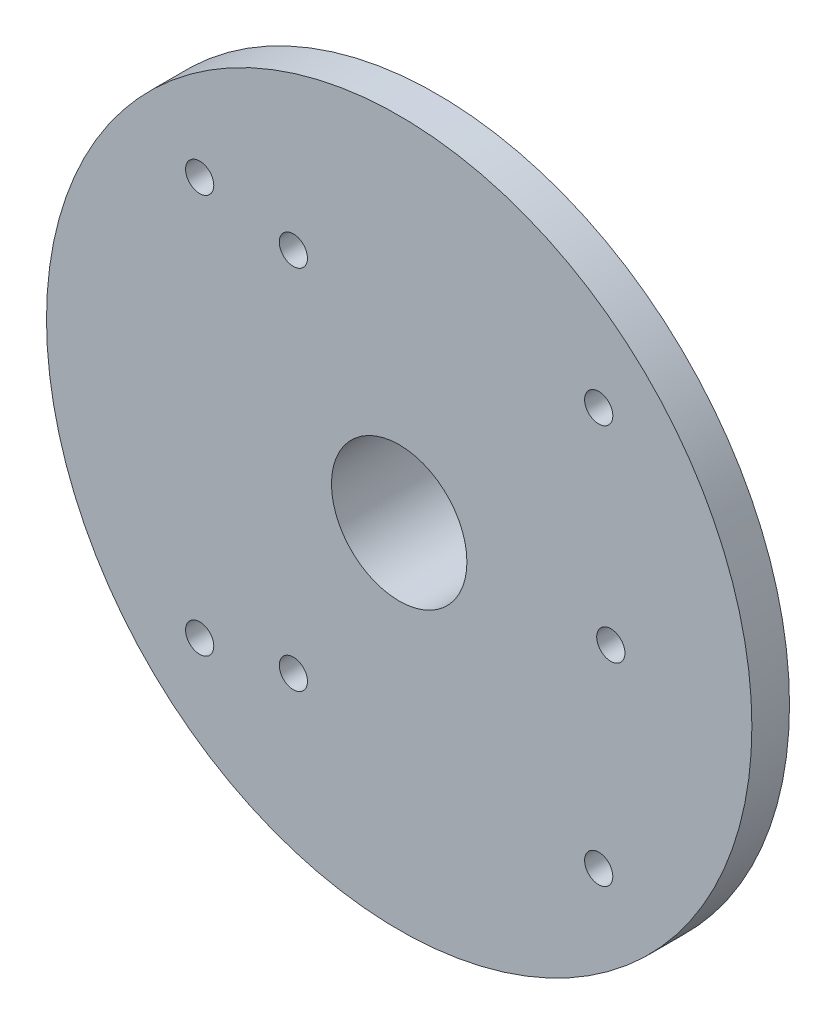
ISO-10303-21;
HEADER;
FILE_DESCRIPTION(('STEP AP214'),'2;1');
FILE_NAME('part.step','',(''),(''),'','','');
FILE_SCHEMA(('AUTOMOTIVE_DESIGN { 1 0 10303 214 1 1 1 1 }'));
ENDSEC;
DATA;
#1=APPLICATION_CONTEXT('core data for automotive mechanical design processes');
#2=APPLICATION_PROTOCOL_DEFINITION('international standard','automotive_design',2000,#1);
#3=PRODUCT_CONTEXT('',#1,'mechanical');
#4=PRODUCT('Part','Part','',(#3));
#5=PRODUCT_RELATED_PRODUCT_CATEGORY('part','',(#4));
#6=PRODUCT_DEFINITION_FORMATION('','',#4);
#7=PRODUCT_DEFINITION_CONTEXT('part definition',#1,'design');
#8=PRODUCT_DEFINITION('design','',#6,#7);
#9=PRODUCT_DEFINITION_SHAPE('','',#8);
#10=(LENGTH_UNIT() NAMED_UNIT(*) SI_UNIT(.MILLI.,.METRE.));
#11=(NAMED_UNIT(*) PLANE_ANGLE_UNIT() SI_UNIT($,.RADIAN.));
#12=(NAMED_UNIT(*) SI_UNIT($,.STERADIAN.) SOLID_ANGLE_UNIT());
#13=UNCERTAINTY_MEASURE_WITH_UNIT(LENGTH_MEASURE(1.E-05),#10,'distance_accuracy_value','');
#14=(GEOMETRIC_REPRESENTATION_CONTEXT(3) GLOBAL_UNCERTAINTY_ASSIGNED_CONTEXT((#13)) GLOBAL_UNIT_ASSIGNED_CONTEXT((#10,
#11,#12)) REPRESENTATION_CONTEXT('',''));
#15=CARTESIAN_POINT('',(0.,0.,0.));
#16=DIRECTION('',(0.,0.,1.));
#17=DIRECTION('',(1.,0.,0.));
#18=AXIS2_PLACEMENT_3D('',#15,#16,#17);
#19=CARTESIAN_POINT('',(0.,0.,0.));
#20=DIRECTION('',(0.,0.,1.));
#21=DIRECTION('',(1.,0.,0.));
#22=AXIS2_PLACEMENT_3D('',#19,#20,#21);
#23=PLANE('',#22);
#24=CARTESIAN_POINT('',(-21.2132034355962,21.2132034355966,0.));
#25=DIRECTION('',(0.,0.,1.));
#26=DIRECTION('',(1.,0.,0.));
#27=AXIS2_PLACEMENT_3D('',#24,#25,#26);
#28=CIRCLE('',#27,1.5);
#29=CARTESIAN_POINT('',(-19.7132034355962,21.2132034355966,0.));
#30=VERTEX_POINT('',#29);
#31=EDGE_CURVE('E112',#30,#30,#28,.T.);
#32=ORIENTED_EDGE('',*,*,#31,.T.);
#33=EDGE_LOOP('',(#32));
#34=FACE_BOUND('',#33,.T.);
#35=CARTESIAN_POINT('',(-21.2132034355952,-21.2132034355976,0.));
#36=DIRECTION('',(0.,0.,1.));
#37=DIRECTION('',(1.,0.,0.));
#38=AXIS2_PLACEMENT_3D('',#35,#36,#37);
#39=CIRCLE('',#38,1.50000000000089);
#40=CARTESIAN_POINT('',(-19.7132034355943,-21.2132034355976,0.));
#41=VERTEX_POINT('',#40);
#42=EDGE_CURVE('E104',#41,#41,#39,.T.);
#43=ORIENTED_EDGE('',*,*,#42,.T.);
#44=EDGE_LOOP('',(#43));
#45=FACE_BOUND('',#44,.T.);
#46=CARTESIAN_POINT('',(21.2132034355964,-21.2132034355965,0.));
#47=DIRECTION('',(0.,0.,1.));
#48=DIRECTION('',(1.,0.,0.));
#49=AXIS2_PLACEMENT_3D('',#46,#47,#48);
#50=CIRCLE('',#49,1.5);
#51=CARTESIAN_POINT('',(22.7132034355964,-21.2132034355965,0.));
#52=VERTEX_POINT('',#51);
#53=EDGE_CURVE('E96',#52,#52,#50,.T.);
#54=ORIENTED_EDGE('',*,*,#53,.T.);
#55=EDGE_LOOP('',(#54));
#56=FACE_BOUND('',#55,.T.);
#57=CARTESIAN_POINT('',(-11.25,19.4855715851499,0.));
#58=DIRECTION('',(0.,0.,1.));
#59=DIRECTION('',(1.,0.,0.));
#60=AXIS2_PLACEMENT_3D('',#57,#58,#59);
#61=CIRCLE('',#60,1.5);
#62=CARTESIAN_POINT('',(-9.75000000000001,19.4855715851499,0.));
#63=VERTEX_POINT('',#62);
#64=EDGE_CURVE('E88',#63,#63,#61,.T.);
#65=ORIENTED_EDGE('',*,*,#64,.T.);
#66=EDGE_LOOP('',(#65));
#67=FACE_BOUND('',#66,.T.);
#68=CARTESIAN_POINT('',(-11.25,-19.4855715851499,0.));
#69=DIRECTION('',(0.,0.,1.));
#70=DIRECTION('',(1.,0.,0.));
#71=AXIS2_PLACEMENT_3D('',#68,#69,#70);
#72=CIRCLE('',#71,1.5);
#73=CARTESIAN_POINT('',(-9.74999999999999,-19.4855715851499,0.));
#74=VERTEX_POINT('',#73);
#75=EDGE_CURVE('E80',#74,#74,#72,.T.);
#76=ORIENTED_EDGE('',*,*,#75,.T.);
#77=EDGE_LOOP('',(#76));
#78=FACE_BOUND('',#77,.T.);
#79=CARTESIAN_POINT('',(21.2132034355964,21.2132034355965,0.));
#80=DIRECTION('',(0.,0.,1.));
#81=DIRECTION('',(1.,0.,0.));
#82=AXIS2_PLACEMENT_3D('',#79,#80,#81);
#83=CIRCLE('',#82,1.5);
#84=CARTESIAN_POINT('',(22.7132034355964,21.2132034355965,0.));
#85=VERTEX_POINT('',#84);
#86=EDGE_CURVE('E72',#85,#85,#83,.T.);
#87=ORIENTED_EDGE('',*,*,#86,.T.);
#88=EDGE_LOOP('',(#87));
#89=FACE_BOUND('',#88,.T.);
#90=CARTESIAN_POINT('',(22.5,0.,0.));
#91=DIRECTION('',(0.,0.,1.));
#92=DIRECTION('',(1.,0.,0.));
#93=AXIS2_PLACEMENT_3D('',#90,#91,#92);
#94=CIRCLE('',#93,1.5);
#95=CARTESIAN_POINT('',(24.,0.,0.));
#96=VERTEX_POINT('',#95);
#97=EDGE_CURVE('E60',#96,#96,#94,.T.);
#98=ORIENTED_EDGE('',*,*,#97,.T.);
#99=EDGE_LOOP('',(#98));
#100=FACE_BOUND('',#99,.T.);
#101=CARTESIAN_POINT('',(0.,0.,0.));
#102=DIRECTION('',(0.,0.,1.));
#103=DIRECTION('',(1.,0.,0.));
#104=AXIS2_PLACEMENT_3D('',#101,#102,#103);
#105=CIRCLE('',#104,37.5);
#106=CARTESIAN_POINT('',(37.5,0.,0.));
#107=VERTEX_POINT('',#106);
#108=EDGE_CURVE('E52',#107,#107,#105,.T.);
#109=ORIENTED_EDGE('',*,*,#108,.F.);
#110=EDGE_LOOP('',(#109));
#111=FACE_BOUND('',#110,.T.);
#112=CARTESIAN_POINT('',(0.,0.,0.));
#113=DIRECTION('',(0.,0.,1.));
#114=DIRECTION('',(1.,0.,0.));
#115=AXIS2_PLACEMENT_3D('',#112,#113,#114);
#116=CIRCLE('',#115,11.2);
#117=CARTESIAN_POINT('',(11.2,0.,0.));
#118=VERTEX_POINT('',#117);
#119=EDGE_CURVE('E10',#118,#118,#116,.F.);
#120=ORIENTED_EDGE('',*,*,#119,.F.);
#121=EDGE_LOOP('',(#120));
#122=FACE_BOUND('',#121,.T.);
#123=ADVANCED_FACE('F39',(#34,#45,#56,#67,#78,#89,#100,#111,#122),#23,.F.);
#124=CARTESIAN_POINT('',(0.,0.,4.));
#125=DIRECTION('',(0.,0.,1.));
#126=DIRECTION('',(1.,0.,0.));
#127=AXIS2_PLACEMENT_3D('',#124,#125,#126);
#128=PLANE('',#127);
#129=CARTESIAN_POINT('',(-21.2132034355952,-21.2132034355976,4.));
#130=DIRECTION('',(0.,0.,1.));
#131=DIRECTION('',(1.,0.,0.));
#132=AXIS2_PLACEMENT_3D('',#129,#130,#131);
#133=CIRCLE('',#132,1.50000000000089);
#134=CARTESIAN_POINT('',(-19.7132034355943,-21.2132034355976,4.));
#135=VERTEX_POINT('',#134);
#136=EDGE_CURVE('E100',#135,#135,#133,.T.);
#137=ORIENTED_EDGE('',*,*,#136,.F.);
#138=EDGE_LOOP('',(#137));
#139=FACE_BOUND('',#138,.T.);
#140=CARTESIAN_POINT('',(-11.25,19.4855715851499,4.));
#141=DIRECTION('',(0.,0.,1.));
#142=DIRECTION('',(1.,0.,0.));
#143=AXIS2_PLACEMENT_3D('',#140,#141,#142);
#144=CIRCLE('',#143,1.5);
#145=CARTESIAN_POINT('',(-9.75000000000001,19.4855715851499,4.));
#146=VERTEX_POINT('',#145);
#147=EDGE_CURVE('E84',#146,#146,#144,.T.);
#148=ORIENTED_EDGE('',*,*,#147,.F.);
#149=EDGE_LOOP('',(#148));
#150=FACE_BOUND('',#149,.T.);
#151=CARTESIAN_POINT('',(21.2132034355964,21.2132034355965,4.));
#152=DIRECTION('',(0.,0.,1.));
#153=DIRECTION('',(1.,0.,0.));
#154=AXIS2_PLACEMENT_3D('',#151,#152,#153);
#155=CIRCLE('',#154,1.5);
#156=CARTESIAN_POINT('',(22.7132034355964,21.2132034355965,4.));
#157=VERTEX_POINT('',#156);
#158=EDGE_CURVE('E71',#157,#157,#155,.T.);
#159=ORIENTED_EDGE('',*,*,#158,.F.);
#160=EDGE_LOOP('',(#159));
#161=FACE_BOUND('',#160,.T.);
#162=CARTESIAN_POINT('',(22.5,0.,4.));
#163=DIRECTION('',(0.,0.,1.));
#164=DIRECTION('',(1.,0.,0.));
#165=AXIS2_PLACEMENT_3D('',#162,#163,#164);
#166=CIRCLE('',#165,1.5);
#167=CARTESIAN_POINT('',(24.,0.,4.));
#168=VERTEX_POINT('',#167);
#169=EDGE_CURVE('E58',#168,#168,#166,.T.);
#170=ORIENTED_EDGE('',*,*,#169,.F.);
#171=EDGE_LOOP('',(#170));
#172=FACE_BOUND('',#171,.T.);
#173=CARTESIAN_POINT('',(0.,0.,4.));
#174=DIRECTION('',(0.,0.,1.));
#175=DIRECTION('',(1.,0.,0.));
#176=AXIS2_PLACEMENT_3D('',#173,#174,#175);
#177=CIRCLE('',#176,37.5);
#178=CARTESIAN_POINT('',(37.5,0.,4.));
#179=VERTEX_POINT('',#178);
#180=EDGE_CURVE('E47',#179,#179,#177,.T.);
#181=ORIENTED_EDGE('',*,*,#180,.T.);
#182=EDGE_LOOP('',(#181));
#183=FACE_BOUND('',#182,.T.);
#184=CARTESIAN_POINT('',(0.,0.,4.));
#185=DIRECTION('',(0.,0.,1.));
#186=DIRECTION('',(1.,0.,0.));
#187=AXIS2_PLACEMENT_3D('',#184,#185,#186);
#188=CIRCLE('',#187,7.2);
#189=CARTESIAN_POINT('',(7.2,0.,4.));
#190=VERTEX_POINT('',#189);
#191=EDGE_CURVE('E64',#190,#190,#188,.T.);
#192=ORIENTED_EDGE('',*,*,#191,.F.);
#193=EDGE_LOOP('',(#192));
#194=FACE_BOUND('',#193,.T.);
#195=CARTESIAN_POINT('',(-11.25,-19.4855715851499,4.));
#196=DIRECTION('',(0.,0.,1.));
#197=DIRECTION('',(1.,0.,0.));
#198=AXIS2_PLACEMENT_3D('',#195,#196,#197);
#199=CIRCLE('',#198,1.5);
#200=CARTESIAN_POINT('',(-9.74999999999999,-19.4855715851499,4.));
#201=VERTEX_POINT('',#200);
#202=EDGE_CURVE('E76',#201,#201,#199,.T.);
#203=ORIENTED_EDGE('',*,*,#202,.F.);
#204=EDGE_LOOP('',(#203));
#205=FACE_BOUND('',#204,.T.);
#206=CARTESIAN_POINT('',(21.2132034355964,-21.2132034355965,4.));
#207=DIRECTION('',(0.,0.,1.));
#208=DIRECTION('',(1.,0.,0.));
#209=AXIS2_PLACEMENT_3D('',#206,#207,#208);
#210=CIRCLE('',#209,1.5);
#211=CARTESIAN_POINT('',(22.7132034355964,-21.2132034355965,4.));
#212=VERTEX_POINT('',#211);
#213=EDGE_CURVE('E92',#212,#212,#210,.T.);
#214=ORIENTED_EDGE('',*,*,#213,.F.);
#215=EDGE_LOOP('',(#214));
#216=FACE_BOUND('',#215,.T.);
#217=CARTESIAN_POINT('',(-21.2132034355962,21.2132034355966,4.));
#218=DIRECTION('',(0.,0.,1.));
#219=DIRECTION('',(1.,0.,0.));
#220=AXIS2_PLACEMENT_3D('',#217,#218,#219);
#221=CIRCLE('',#220,1.5);
#222=CARTESIAN_POINT('',(-19.7132034355962,21.2132034355966,4.));
#223=VERTEX_POINT('',#222);
#224=EDGE_CURVE('E108',#223,#223,#221,.T.);
#225=ORIENTED_EDGE('',*,*,#224,.F.);
#226=EDGE_LOOP('',(#225));
#227=FACE_BOUND('',#226,.T.);
#228=ADVANCED_FACE('F146',(#139,#150,#161,#172,#183,#194,#205,#216,#227),#128,.T.);
#229=CARTESIAN_POINT('',(0.,0.,4.));
#230=DIRECTION('',(0.,0.,-1.));
#231=DIRECTION('',(-1.,0.,0.));
#232=AXIS2_PLACEMENT_3D('',#229,#230,#231);
#233=CYLINDRICAL_SURFACE('',#232,37.5);
#234=ORIENTED_EDGE('',*,*,#180,.F.);
#235=EDGE_LOOP('',(#234));
#236=FACE_BOUND('',#235,.T.);
#237=ORIENTED_EDGE('',*,*,#108,.T.);
#238=EDGE_LOOP('',(#237));
#239=FACE_BOUND('',#238,.T.);
#240=ADVANCED_FACE('F41',(#236,#239),#233,.T.);
#241=CARTESIAN_POINT('',(22.5,0.,4.));
#242=DIRECTION('',(0.,0.,-1.));
#243=DIRECTION('',(-1.,0.,0.));
#244=AXIS2_PLACEMENT_3D('',#241,#242,#243);
#245=CYLINDRICAL_SURFACE('',#244,1.5);
#246=ORIENTED_EDGE('',*,*,#169,.T.);
#247=EDGE_LOOP('',(#246));
#248=FACE_BOUND('',#247,.T.);
#249=ORIENTED_EDGE('',*,*,#97,.F.);
#250=EDGE_LOOP('',(#249));
#251=FACE_BOUND('',#250,.T.);
#252=ADVANCED_FACE('F155',(#248,#251),#245,.F.);
#253=CARTESIAN_POINT('',(0.,0.,4.));
#254=DIRECTION('',(0.,0.,-1.));
#255=DIRECTION('',(-1.,0.,0.));
#256=AXIS2_PLACEMENT_3D('',#253,#254,#255);
#257=CYLINDRICAL_SURFACE('',#256,7.2);
#258=ORIENTED_EDGE('',*,*,#191,.T.);
#259=EDGE_LOOP('',(#258));
#260=FACE_BOUND('',#259,.T.);
#261=CARTESIAN_POINT('',(0.,0.,-8.));
#262=DIRECTION('',(0.,0.,-1.));
#263=DIRECTION('',(-1.,0.,0.));
#264=AXIS2_PLACEMENT_3D('',#261,#262,#263);
#265=CIRCLE('',#264,7.2);
#266=CARTESIAN_POINT('',(-7.2,0.,-8.));
#267=VERTEX_POINT('',#266);
#268=EDGE_CURVE('E123',#267,#267,#265,.T.);
#269=ORIENTED_EDGE('',*,*,#268,.T.);
#270=EDGE_LOOP('',(#269));
#271=FACE_BOUND('',#270,.T.);
#272=ADVANCED_FACE('F128',(#260,#271),#257,.F.);
#273=CARTESIAN_POINT('',(21.2132034355964,21.2132034355965,4.));
#274=DIRECTION('',(0.,0.,-1.));
#275=DIRECTION('',(-1.,0.,0.));
#276=AXIS2_PLACEMENT_3D('',#273,#274,#275);
#277=CYLINDRICAL_SURFACE('',#276,1.5);
#278=ORIENTED_EDGE('',*,*,#158,.T.);
#279=EDGE_LOOP('',(#278));
#280=FACE_BOUND('',#279,.T.);
#281=ORIENTED_EDGE('',*,*,#86,.F.);
#282=EDGE_LOOP('',(#281));
#283=FACE_BOUND('',#282,.T.);
#284=ADVANCED_FACE('F161',(#280,#283),#277,.F.);
#285=CARTESIAN_POINT('',(-11.25,-19.4855715851499,4.));
#286=DIRECTION('',(0.,0.,-1.));
#287=DIRECTION('',(-1.,0.,0.));
#288=AXIS2_PLACEMENT_3D('',#285,#286,#287);
#289=CYLINDRICAL_SURFACE('',#288,1.5);
#290=ORIENTED_EDGE('',*,*,#202,.T.);
#291=EDGE_LOOP('',(#290));
#292=FACE_BOUND('',#291,.T.);
#293=ORIENTED_EDGE('',*,*,#75,.F.);
#294=EDGE_LOOP('',(#293));
#295=FACE_BOUND('',#294,.T.);
#296=ADVANCED_FACE('F165',(#292,#295),#289,.F.);
#297=CARTESIAN_POINT('',(-11.25,19.4855715851499,4.));
#298=DIRECTION('',(0.,0.,-1.));
#299=DIRECTION('',(-1.,0.,0.));
#300=AXIS2_PLACEMENT_3D('',#297,#298,#299);
#301=CYLINDRICAL_SURFACE('',#300,1.5);
#302=ORIENTED_EDGE('',*,*,#147,.T.);
#303=EDGE_LOOP('',(#302));
#304=FACE_BOUND('',#303,.T.);
#305=ORIENTED_EDGE('',*,*,#64,.F.);
#306=EDGE_LOOP('',(#305));
#307=FACE_BOUND('',#306,.T.);
#308=ADVANCED_FACE('F169',(#304,#307),#301,.F.);
#309=CARTESIAN_POINT('',(21.2132034355964,-21.2132034355965,4.));
#310=DIRECTION('',(0.,0.,-1.));
#311=DIRECTION('',(-1.,0.,0.));
#312=AXIS2_PLACEMENT_3D('',#309,#310,#311);
#313=CYLINDRICAL_SURFACE('',#312,1.5);
#314=ORIENTED_EDGE('',*,*,#213,.T.);
#315=EDGE_LOOP('',(#314));
#316=FACE_BOUND('',#315,.T.);
#317=ORIENTED_EDGE('',*,*,#53,.F.);
#318=EDGE_LOOP('',(#317));
#319=FACE_BOUND('',#318,.T.);
#320=ADVANCED_FACE('F173',(#316,#319),#313,.F.);
#321=CARTESIAN_POINT('',(-21.2132034355952,-21.2132034355976,4.));
#322=DIRECTION('',(0.,0.,-1.));
#323=DIRECTION('',(-1.,0.,0.));
#324=AXIS2_PLACEMENT_3D('',#321,#322,#323);
#325=CYLINDRICAL_SURFACE('',#324,1.50000000000089);
#326=ORIENTED_EDGE('',*,*,#136,.T.);
#327=EDGE_LOOP('',(#326));
#328=FACE_BOUND('',#327,.T.);
#329=ORIENTED_EDGE('',*,*,#42,.F.);
#330=EDGE_LOOP('',(#329));
#331=FACE_BOUND('',#330,.T.);
#332=ADVANCED_FACE('F142',(#328,#331),#325,.F.);
#333=CARTESIAN_POINT('',(-21.2132034355962,21.2132034355966,4.));
#334=DIRECTION('',(0.,0.,-1.));
#335=DIRECTION('',(-1.,0.,0.));
#336=AXIS2_PLACEMENT_3D('',#333,#334,#335);
#337=CYLINDRICAL_SURFACE('',#336,1.5);
#338=ORIENTED_EDGE('',*,*,#224,.T.);
#339=EDGE_LOOP('',(#338));
#340=FACE_BOUND('',#339,.T.);
#341=ORIENTED_EDGE('',*,*,#31,.F.);
#342=EDGE_LOOP('',(#341));
#343=FACE_BOUND('',#342,.T.);
#344=ADVANCED_FACE('F133',(#340,#343),#337,.F.);
#345=CARTESIAN_POINT('',(0.,0.,-8.));
#346=DIRECTION('',(0.,0.,-1.));
#347=DIRECTION('',(-1.,0.,0.));
#348=AXIS2_PLACEMENT_3D('',#345,#346,#347);
#349=PLANE('',#348);
#350=CARTESIAN_POINT('',(0.,0.,-8.));
#351=DIRECTION('',(0.,0.,-1.));
#352=DIRECTION('',(-1.,0.,0.));
#353=AXIS2_PLACEMENT_3D('',#350,#351,#352);
#354=CIRCLE('',#353,11.2);
#355=CARTESIAN_POINT('',(-11.2,0.,-8.));
#356=VERTEX_POINT('',#355);
#357=EDGE_CURVE('E116',#356,#356,#354,.T.);
#358=ORIENTED_EDGE('',*,*,#357,.T.);
#359=EDGE_LOOP('',(#358));
#360=FACE_BOUND('',#359,.T.);
#361=ORIENTED_EDGE('',*,*,#268,.F.);
#362=EDGE_LOOP('',(#361));
#363=FACE_BOUND('',#362,.T.);
#364=ADVANCED_FACE('F130',(#360,#363),#349,.T.);
#365=CARTESIAN_POINT('',(0.,0.,-8.));
#366=DIRECTION('',(0.,0.,1.));
#367=DIRECTION('',(1.,0.,0.));
#368=AXIS2_PLACEMENT_3D('',#365,#366,#367);
#369=CYLINDRICAL_SURFACE('',#368,11.2);
#370=ORIENTED_EDGE('',*,*,#357,.F.);
#371=EDGE_LOOP('',(#370));
#372=FACE_BOUND('',#371,.T.);
#373=ORIENTED_EDGE('',*,*,#119,.T.);
#374=EDGE_LOOP('',(#373));
#375=FACE_BOUND('',#374,.T.);
#376=ADVANCED_FACE('F132',(#372,#375),#369,.T.);
#377=CLOSED_SHELL('',(#123,#228,#240,#252,#272,#284,#296,#308,#320,#332,#344,#364,#376));
#378=MANIFOLD_SOLID_BREP('B2',#377);
#379=ADVANCED_BREP_SHAPE_REPRESENTATION('',(#18,#378),#14);
#380=SHAPE_DEFINITION_REPRESENTATION(#9,#379);
ENDSEC;
END-ISO-10303-21;
